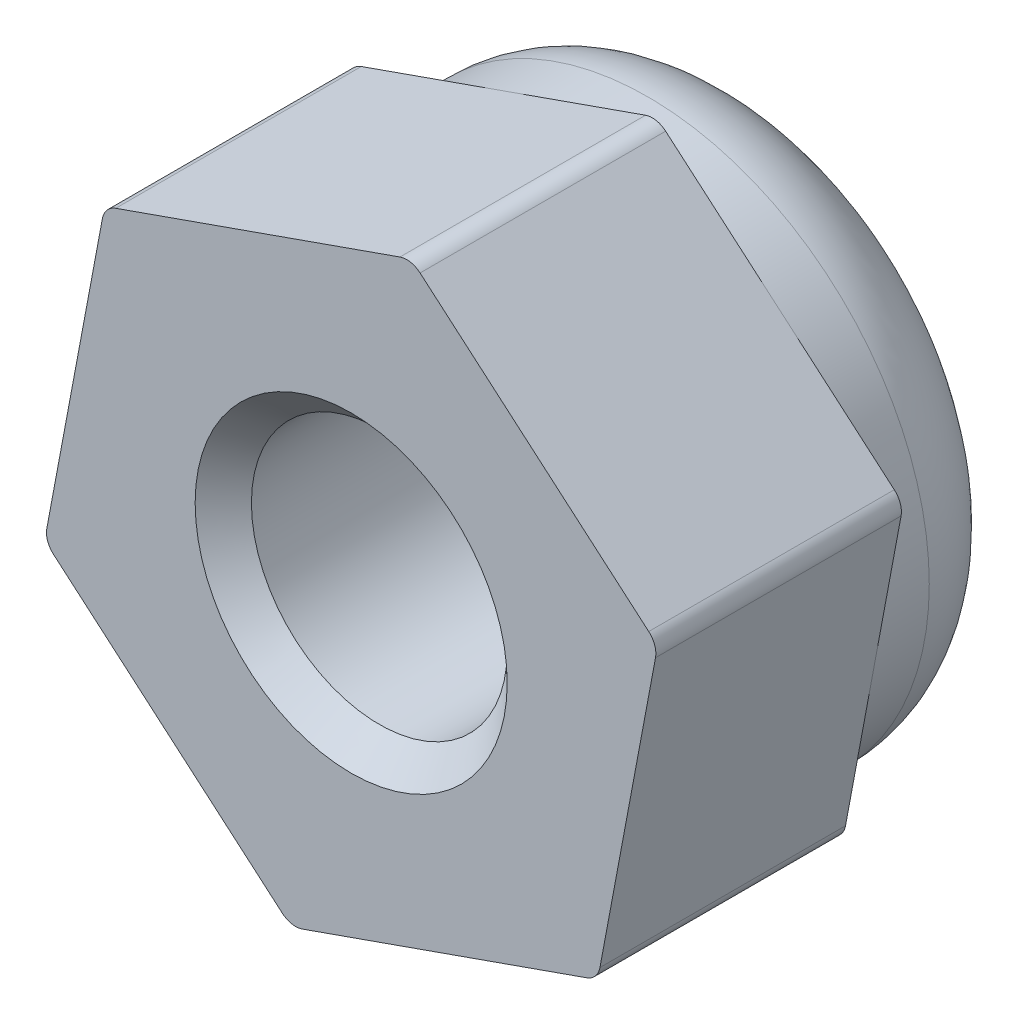
ISO-10303-21;
HEADER;
FILE_DESCRIPTION(('STEP AP214'),'2;1');
FILE_NAME('part.step','',(''),(''),'','','');
FILE_SCHEMA(('AUTOMOTIVE_DESIGN { 1 0 10303 214 1 1 1 1 }'));
ENDSEC;
DATA;
#1=APPLICATION_CONTEXT('core data for automotive mechanical design processes');
#2=APPLICATION_PROTOCOL_DEFINITION('international standard','automotive_design',2000,#1);
#3=PRODUCT_CONTEXT('',#1,'mechanical');
#4=PRODUCT('Part','Part','',(#3));
#5=PRODUCT_RELATED_PRODUCT_CATEGORY('part','',(#4));
#6=PRODUCT_DEFINITION_FORMATION('','',#4);
#7=PRODUCT_DEFINITION_CONTEXT('part definition',#1,'design');
#8=PRODUCT_DEFINITION('design','',#6,#7);
#9=PRODUCT_DEFINITION_SHAPE('','',#8);
#10=(LENGTH_UNIT() NAMED_UNIT(*) SI_UNIT(.MILLI.,.METRE.));
#11=(NAMED_UNIT(*) PLANE_ANGLE_UNIT() SI_UNIT($,.RADIAN.));
#12=(NAMED_UNIT(*) SI_UNIT($,.STERADIAN.) SOLID_ANGLE_UNIT());
#13=UNCERTAINTY_MEASURE_WITH_UNIT(LENGTH_MEASURE(1.E-05),#10,'distance_accuracy_value','');
#14=(GEOMETRIC_REPRESENTATION_CONTEXT(3) GLOBAL_UNCERTAINTY_ASSIGNED_CONTEXT((#13)) GLOBAL_UNIT_ASSIGNED_CONTEXT((#10,
#11,#12)) REPRESENTATION_CONTEXT('',''));
#15=CARTESIAN_POINT('',(0.,0.,0.));
#16=DIRECTION('',(0.,0.,1.));
#17=DIRECTION('',(1.,0.,0.));
#18=AXIS2_PLACEMENT_3D('',#15,#16,#17);
#19=CARTESIAN_POINT('',(0.,0.,0.));
#20=DIRECTION('',(0.,0.,1.));
#21=DIRECTION('',(1.,0.,0.));
#22=AXIS2_PLACEMENT_3D('',#19,#20,#21);
#23=PLANE('',#22);
#24=DIRECTION('',(-0.943398811601491,-0.331660492475205,0.));
#25=VECTOR('',#24,1.);
#26=CARTESIAN_POINT('',(0.585780429729244,3.12092848708194,0.));
#27=LINE('',#26,#25);
#28=CARTESIAN_POINT('',(0.476846118162986,3.08263163215991,0.));
#29=VERTEX_POINT('',#28);
#30=CARTESIAN_POINT('',(-0.912066354306814,2.5943467319041,0.));
#31=VERTEX_POINT('',#30);
#32=EDGE_CURVE('E200',#29,#31,#27,.T.);
#33=ORIENTED_EDGE('',*,*,#32,.F.);
#34=CARTESIAN_POINT('',(0.543178216658027,2.89395186983962,0.));
#35=DIRECTION('',(0.,0.,1.));
#36=DIRECTION('',(1.,0.,0.));
#37=AXIS2_PLACEMENT_3D('',#34,#35,#36);
#38=CIRCLE('',#37,0.2);
#39=CARTESIAN_POINT('',(0.673413634759894,3.0457370333828,0.));
#40=VERTEX_POINT('',#39);
#41=EDGE_CURVE('E269',#29,#40,#38,.F.);
#42=ORIENTED_EDGE('',*,*,#41,.T.);
#43=DIRECTION('',(-0.75892581771593,0.651177090509338,0.));
#44=VECTOR('',#43,1.);
#45=CARTESIAN_POINT('',(2.99569356807211,1.05316351035568,0.));
#46=LINE('',#45,#44);
#47=CARTESIAN_POINT('',(1.79073699890068,2.08704599871881,0.));
#48=VERTEX_POINT('',#47);
#49=EDGE_CURVE('E162',#48,#40,#46,.T.);
#50=ORIENTED_EDGE('',*,*,#49,.F.);
#51=CARTESIAN_POINT('',(0.,0.,0.));
#52=DIRECTION('',(0.,0.,1.));
#53=DIRECTION('',(1.,0.,0.));
#54=AXIS2_PLACEMENT_3D('',#51,#52,#53);
#55=CIRCLE('',#54,2.75);
#56=EDGE_CURVE('E175',#48,#31,#55,.T.);
#57=ORIENTED_EDGE('',*,*,#56,.T.);
#58=EDGE_LOOP('',(#33,#42,#50,#57));
#59=FACE_BOUND('',#58,.T.);
#60=ADVANCED_FACE('F41',(#59),#23,.F.);
#61=DIRECTION('',(-0.18447299388556,-0.982837582984543,0.));
#62=VECTOR('',#61,1.);
#63=CARTESIAN_POINT('',(-2.40991313834287,2.06776497672626,0.));
#64=LINE('',#63,#62);
#65=CARTESIAN_POINT('',(-2.43121424487848,1.9542766681051,0.));
#66=VERTEX_POINT('',#65);
#67=CARTESIAN_POINT('',(-2.70280335320749,0.507300733185291,0.));
#68=VERTEX_POINT('',#67);
#69=EDGE_CURVE('E204',#66,#68,#64,.T.);
#70=ORIENTED_EDGE('',*,*,#69,.F.);
#71=CARTESIAN_POINT('',(-2.23464672828157,1.91738206932799,0.));
#72=DIRECTION('',(0.,0.,1.));
#73=DIRECTION('',(1.,0.,0.));
#74=AXIS2_PLACEMENT_3D('',#71,#72,#73);
#75=CIRCLE('',#74,0.2);
#76=CARTESIAN_POINT('',(-2.30097882677661,2.10606183164828,0.));
#77=VERTEX_POINT('',#76);
#78=EDGE_CURVE('E279',#66,#77,#75,.F.);
#79=ORIENTED_EDGE('',*,*,#78,.T.);
#80=EDGE_CURVE('E199',#31,#77,#27,.T.);
#81=ORIENTED_EDGE('',*,*,#80,.F.);
#82=EDGE_CURVE('E426',#31,#68,#55,.T.);
#83=ORIENTED_EDGE('',*,*,#82,.T.);
#84=EDGE_LOOP('',(#70,#79,#81,#83));
#85=FACE_BOUND('',#84,.T.);
#86=ADVANCED_FACE('F353',(#85),#23,.F.);
#87=DIRECTION('',(0.75892581771593,-0.651177090509338,0.));
#88=VECTOR('',#87,1.);
#89=CARTESIAN_POINT('',(-2.99569356807212,-1.05316351035568,0.));
#90=LINE('',#89,#88);
#91=CARTESIAN_POINT('',(-2.90806036304147,-1.12835496405481,0.));
#92=VERTEX_POINT('',#91);
#93=CARTESIAN_POINT('',(-1.79073699890068,-2.08704599871881,0.));
#94=VERTEX_POINT('',#93);
#95=EDGE_CURVE('E208',#92,#94,#90,.T.);
#96=ORIENTED_EDGE('',*,*,#95,.F.);
#97=CARTESIAN_POINT('',(-2.7778249449396,-0.976569800511629,0.));
#98=DIRECTION('',(0.,0.,1.));
#99=DIRECTION('',(1.,0.,0.));
#100=AXIS2_PLACEMENT_3D('',#97,#98,#99);
#101=CIRCLE('',#100,0.2);
#102=CARTESIAN_POINT('',(-2.97439246153651,-0.939675201734518,0.));
#103=VERTEX_POINT('',#102);
#104=EDGE_CURVE('E51',#92,#103,#101,.F.);
#105=ORIENTED_EDGE('',*,*,#104,.T.);
#106=EDGE_CURVE('E203',#68,#103,#64,.T.);
#107=ORIENTED_EDGE('',*,*,#106,.F.);
#108=EDGE_CURVE('E428',#68,#94,#55,.T.);
#109=ORIENTED_EDGE('',*,*,#108,.T.);
#110=EDGE_LOOP('',(#96,#105,#107,#109));
#111=FACE_BOUND('',#110,.T.);
#112=ADVANCED_FACE('F293',(#111),#23,.F.);
#113=DIRECTION('',(0.94339881160149,0.331660492475205,0.));
#114=VECTOR('',#113,1.);
#115=CARTESIAN_POINT('',(-0.585780429729246,-3.12092848708194,0.));
#116=LINE('',#115,#114);
#117=CARTESIAN_POINT('',(-0.476846118162987,-3.08263163215991,0.));
#118=VERTEX_POINT('',#117);
#119=CARTESIAN_POINT('',(0.912066354306814,-2.5943467319041,0.));
#120=VERTEX_POINT('',#119);
#121=EDGE_CURVE('E191',#118,#120,#116,.T.);
#122=ORIENTED_EDGE('',*,*,#121,.F.);
#123=CARTESIAN_POINT('',(-0.543178216658028,-2.89395186983962,0.));
#124=DIRECTION('',(0.,0.,1.));
#125=DIRECTION('',(1.,0.,0.));
#126=AXIS2_PLACEMENT_3D('',#123,#124,#125);
#127=CIRCLE('',#126,0.2);
#128=CARTESIAN_POINT('',(-0.673413634759897,-3.0457370333828,0.));
#129=VERTEX_POINT('',#128);
#130=EDGE_CURVE('E11',#118,#129,#127,.F.);
#131=ORIENTED_EDGE('',*,*,#130,.T.);
#132=EDGE_CURVE('E207',#94,#129,#90,.T.);
#133=ORIENTED_EDGE('',*,*,#132,.F.);
#134=EDGE_CURVE('E187',#94,#120,#55,.T.);
#135=ORIENTED_EDGE('',*,*,#134,.T.);
#136=EDGE_LOOP('',(#122,#131,#133,#135));
#137=FACE_BOUND('',#136,.T.);
#138=ADVANCED_FACE('F432',(#137),#23,.F.);
#139=DIRECTION('',(0.184472993885561,0.982837582984543,0.));
#140=VECTOR('',#139,1.);
#141=CARTESIAN_POINT('',(2.40991313834287,-2.06776497672626,0.));
#142=LINE('',#141,#140);
#143=CARTESIAN_POINT('',(2.43121424487848,-1.9542766681051,0.));
#144=VERTEX_POINT('',#143);
#145=CARTESIAN_POINT('',(2.70280335320749,-0.507300733185292,0.));
#146=VERTEX_POINT('',#145);
#147=EDGE_CURVE('E150',#144,#146,#142,.T.);
#148=ORIENTED_EDGE('',*,*,#147,.F.);
#149=CARTESIAN_POINT('',(2.23464672828157,-1.91738206932799,0.));
#150=DIRECTION('',(0.,0.,1.));
#151=DIRECTION('',(1.,0.,0.));
#152=AXIS2_PLACEMENT_3D('',#149,#150,#151);
#153=CIRCLE('',#152,0.2);
#154=CARTESIAN_POINT('',(2.30097882677661,-2.10606183164828,0.));
#155=VERTEX_POINT('',#154);
#156=EDGE_CURVE('E225',#144,#155,#153,.F.);
#157=ORIENTED_EDGE('',*,*,#156,.T.);
#158=EDGE_CURVE('E185',#120,#155,#116,.T.);
#159=ORIENTED_EDGE('',*,*,#158,.F.);
#160=EDGE_CURVE('E171',#120,#146,#55,.T.);
#161=ORIENTED_EDGE('',*,*,#160,.T.);
#162=EDGE_LOOP('',(#148,#157,#159,#161));
#163=FACE_BOUND('',#162,.T.);
#164=ADVANCED_FACE('F183',(#163),#23,.F.);
#165=CARTESIAN_POINT('',(-0.585780429729246,-3.12092848708194,2.4));
#166=DIRECTION('',(-0.331660492475205,0.94339881160149,0.));
#167=DIRECTION('',(-0.943398811601491,-0.331660492475205,0.));
#168=AXIS2_PLACEMENT_3D('',#165,#166,#167);
#169=PLANE('',#168);
#170=ORIENTED_EDGE('',*,*,#158,.T.);
#171=DIRECTION('',(0.,0.,-1.));
#172=VECTOR('',#171,1.);
#173=CARTESIAN_POINT('',(2.30097882677661,-2.10606183164828,2.4));
#174=LINE('',#173,#172);
#175=CARTESIAN_POINT('',(2.30097882677661,-2.10606183164828,2.4));
#176=VERTEX_POINT('',#175);
#177=EDGE_CURVE('E232',#155,#176,#174,.F.);
#178=ORIENTED_EDGE('',*,*,#177,.T.);
#179=DIRECTION('',(0.94339881160149,0.331660492475205,0.));
#180=VECTOR('',#179,1.);
#181=CARTESIAN_POINT('',(-0.585780429729246,-3.12092848708194,2.4));
#182=LINE('',#181,#180);
#183=CARTESIAN_POINT('',(-0.476846118162987,-3.08263163215991,2.4));
#184=VERTEX_POINT('',#183);
#185=EDGE_CURVE('E210',#184,#176,#182,.T.);
#186=ORIENTED_EDGE('',*,*,#185,.F.);
#187=DIRECTION('',(0.,0.,-1.));
#188=VECTOR('',#187,1.);
#189=CARTESIAN_POINT('',(-0.476846118162987,-3.08263163215991,2.4));
#190=LINE('',#189,#188);
#191=EDGE_CURVE('E228',#184,#118,#190,.T.);
#192=ORIENTED_EDGE('',*,*,#191,.T.);
#193=ORIENTED_EDGE('',*,*,#121,.T.);
#194=EDGE_LOOP('',(#170,#178,#186,#192,#193));
#195=FACE_BOUND('',#194,.T.);
#196=ADVANCED_FACE('F373',(#195),#169,.F.);
#197=CARTESIAN_POINT('',(2.40991313834287,-2.06776497672626,2.4));
#198=DIRECTION('',(-0.982837582984543,0.184472993885561,0.));
#199=DIRECTION('',(-0.184472993885561,-0.982837582984543,0.));
#200=AXIS2_PLACEMENT_3D('',#197,#198,#199);
#201=PLANE('',#200);
#202=DIRECTION('',(0.184472993885561,0.982837582984543,0.));
#203=VECTOR('',#202,1.);
#204=CARTESIAN_POINT('',(2.40991313834287,-2.06776497672626,2.4));
#205=LINE('',#204,#203);
#206=CARTESIAN_POINT('',(2.43121424487848,-1.9542766681051,2.4));
#207=VERTEX_POINT('',#206);
#208=CARTESIAN_POINT('',(2.97439246153651,0.939675201734518,2.4));
#209=VERTEX_POINT('',#208);
#210=EDGE_CURVE('E326',#207,#209,#205,.T.);
#211=ORIENTED_EDGE('',*,*,#210,.F.);
#212=DIRECTION('',(0.,0.,-1.));
#213=VECTOR('',#212,1.);
#214=CARTESIAN_POINT('',(2.43121424487848,-1.9542766681051,2.4));
#215=LINE('',#214,#213);
#216=EDGE_CURVE('E158',#207,#144,#215,.T.);
#217=ORIENTED_EDGE('',*,*,#216,.T.);
#218=ORIENTED_EDGE('',*,*,#147,.T.);
#219=CARTESIAN_POINT('',(2.97439246153651,0.939675201734518,0.));
#220=VERTEX_POINT('',#219);
#221=EDGE_CURVE('E155',#146,#220,#142,.T.);
#222=ORIENTED_EDGE('',*,*,#221,.T.);
#223=DIRECTION('',(0.,0.,-1.));
#224=VECTOR('',#223,1.);
#225=CARTESIAN_POINT('',(2.97439246153651,0.939675201734517,2.4));
#226=LINE('',#225,#224);
#227=EDGE_CURVE('E220',#220,#209,#226,.F.);
#228=ORIENTED_EDGE('',*,*,#227,.T.);
#229=EDGE_LOOP('',(#211,#217,#218,#222,#228));
#230=FACE_BOUND('',#229,.T.);
#231=ADVANCED_FACE('F153',(#230),#201,.F.);
#232=CARTESIAN_POINT('',(2.99569356807211,1.05316351035568,2.4));
#233=DIRECTION('',(-0.651177090509338,-0.75892581771593,0.));
#234=DIRECTION('',(0.75892581771593,-0.651177090509338,0.));
#235=AXIS2_PLACEMENT_3D('',#232,#233,#234);
#236=PLANE('',#235);
#237=DIRECTION('',(-0.75892581771593,0.651177090509338,0.));
#238=VECTOR('',#237,1.);
#239=CARTESIAN_POINT('',(2.99569356807211,1.05316351035568,2.4));
#240=LINE('',#239,#238);
#241=CARTESIAN_POINT('',(2.90806036304146,1.12835496405482,2.4));
#242=VERTEX_POINT('',#241);
#243=CARTESIAN_POINT('',(0.673413634759894,3.0457370333828,2.4));
#244=VERTEX_POINT('',#243);
#245=EDGE_CURVE('E322',#242,#244,#240,.T.);
#246=ORIENTED_EDGE('',*,*,#245,.F.);
#247=DIRECTION('',(0.,0.,-1.));
#248=VECTOR('',#247,1.);
#249=CARTESIAN_POINT('',(2.90806036304146,1.12835496405482,2.4));
#250=LINE('',#249,#248);
#251=CARTESIAN_POINT('',(2.90806036304146,1.12835496405482,0.));
#252=VERTEX_POINT('',#251);
#253=EDGE_CURVE('E256',#242,#252,#250,.T.);
#254=ORIENTED_EDGE('',*,*,#253,.T.);
#255=EDGE_CURVE('E196',#252,#48,#46,.T.);
#256=ORIENTED_EDGE('',*,*,#255,.T.);
#257=ORIENTED_EDGE('',*,*,#49,.T.);
#258=DIRECTION('',(0.,0.,-1.));
#259=VECTOR('',#258,1.);
#260=CARTESIAN_POINT('',(0.673413634759894,3.0457370333828,2.4));
#261=LINE('',#260,#259);
#262=EDGE_CURVE('E253',#40,#244,#261,.F.);
#263=ORIENTED_EDGE('',*,*,#262,.T.);
#264=EDGE_LOOP('',(#246,#254,#256,#257,#263));
#265=FACE_BOUND('',#264,.T.);
#266=ADVANCED_FACE('F366',(#265),#236,.F.);
#267=CARTESIAN_POINT('',(0.585780429729244,3.12092848708194,2.4));
#268=DIRECTION('',(0.331660492475205,-0.94339881160149,0.));
#269=DIRECTION('',(0.943398811601491,0.331660492475205,0.));
#270=AXIS2_PLACEMENT_3D('',#267,#268,#269);
#271=PLANE('',#270);
#272=DIRECTION('',(-0.943398811601491,-0.331660492475205,0.));
#273=VECTOR('',#272,1.);
#274=CARTESIAN_POINT('',(0.585780429729244,3.12092848708194,2.4));
#275=LINE('',#274,#273);
#276=CARTESIAN_POINT('',(0.476846118162986,3.08263163215991,2.4));
#277=VERTEX_POINT('',#276);
#278=CARTESIAN_POINT('',(-2.30097882677661,2.10606183164828,2.4));
#279=VERTEX_POINT('',#278);
#280=EDGE_CURVE('E316',#277,#279,#275,.T.);
#281=ORIENTED_EDGE('',*,*,#280,.F.);
#282=DIRECTION('',(0.,0.,-1.));
#283=VECTOR('',#282,1.);
#284=CARTESIAN_POINT('',(0.476846118162986,3.08263163215991,2.4));
#285=LINE('',#284,#283);
#286=EDGE_CURVE('E265',#277,#29,#285,.T.);
#287=ORIENTED_EDGE('',*,*,#286,.T.);
#288=ORIENTED_EDGE('',*,*,#32,.T.);
#289=ORIENTED_EDGE('',*,*,#80,.T.);
#290=DIRECTION('',(0.,0.,-1.));
#291=VECTOR('',#290,1.);
#292=CARTESIAN_POINT('',(-2.30097882677661,2.10606183164828,2.4));
#293=LINE('',#292,#291);
#294=EDGE_CURVE('E262',#77,#279,#293,.F.);
#295=ORIENTED_EDGE('',*,*,#294,.T.);
#296=EDGE_LOOP('',(#281,#287,#288,#289,#295));
#297=FACE_BOUND('',#296,.T.);
#298=ADVANCED_FACE('F363',(#297),#271,.F.);
#299=CARTESIAN_POINT('',(-2.40991313834287,2.06776497672626,2.4));
#300=DIRECTION('',(0.982837582984543,-0.18447299388556,0.));
#301=DIRECTION('',(0.18447299388556,0.982837582984543,0.));
#302=AXIS2_PLACEMENT_3D('',#299,#300,#301);
#303=PLANE('',#302);
#304=DIRECTION('',(-0.18447299388556,-0.982837582984543,0.));
#305=VECTOR('',#304,1.);
#306=CARTESIAN_POINT('',(-2.40991313834287,2.06776497672626,2.4));
#307=LINE('',#306,#305);
#308=CARTESIAN_POINT('',(-2.43121424487848,1.9542766681051,2.4));
#309=VERTEX_POINT('',#308);
#310=CARTESIAN_POINT('',(-2.97439246153651,-0.939675201734518,2.4));
#311=VERTEX_POINT('',#310);
#312=EDGE_CURVE('E310',#309,#311,#307,.T.);
#313=ORIENTED_EDGE('',*,*,#312,.F.);
#314=DIRECTION('',(0.,0.,-1.));
#315=VECTOR('',#314,1.);
#316=CARTESIAN_POINT('',(-2.43121424487848,1.9542766681051,2.4));
#317=LINE('',#316,#315);
#318=EDGE_CURVE('E275',#309,#66,#317,.T.);
#319=ORIENTED_EDGE('',*,*,#318,.T.);
#320=ORIENTED_EDGE('',*,*,#69,.T.);
#321=ORIENTED_EDGE('',*,*,#106,.T.);
#322=DIRECTION('',(0.,0.,-1.));
#323=VECTOR('',#322,1.);
#324=CARTESIAN_POINT('',(-2.97439246153651,-0.939675201734517,2.4));
#325=LINE('',#324,#323);
#326=EDGE_CURVE('E272',#103,#311,#325,.F.);
#327=ORIENTED_EDGE('',*,*,#326,.T.);
#328=EDGE_LOOP('',(#313,#319,#320,#321,#327));
#329=FACE_BOUND('',#328,.T.);
#330=ADVANCED_FACE('F297',(#329),#303,.F.);
#331=CARTESIAN_POINT('',(-2.99569356807212,-1.05316351035568,2.4));
#332=DIRECTION('',(0.651177090509338,0.75892581771593,0.));
#333=DIRECTION('',(-0.75892581771593,0.651177090509338,0.));
#334=AXIS2_PLACEMENT_3D('',#331,#332,#333);
#335=PLANE('',#334);
#336=DIRECTION('',(0.75892581771593,-0.651177090509338,0.));
#337=VECTOR('',#336,1.);
#338=CARTESIAN_POINT('',(-2.99569356807212,-1.05316351035568,2.4));
#339=LINE('',#338,#337);
#340=CARTESIAN_POINT('',(-2.90806036304147,-1.12835496405481,2.4));
#341=VERTEX_POINT('',#340);
#342=CARTESIAN_POINT('',(-0.673413634759897,-3.0457370333828,2.4));
#343=VERTEX_POINT('',#342);
#344=EDGE_CURVE('E180',#341,#343,#339,.T.);
#345=ORIENTED_EDGE('',*,*,#344,.F.);
#346=DIRECTION('',(0.,0.,-1.));
#347=VECTOR('',#346,1.);
#348=CARTESIAN_POINT('',(-2.90806036304147,-1.12835496405481,2.4));
#349=LINE('',#348,#347);
#350=EDGE_CURVE('E285',#341,#92,#349,.T.);
#351=ORIENTED_EDGE('',*,*,#350,.T.);
#352=ORIENTED_EDGE('',*,*,#95,.T.);
#353=ORIENTED_EDGE('',*,*,#132,.T.);
#354=DIRECTION('',(0.,0.,-1.));
#355=VECTOR('',#354,1.);
#356=CARTESIAN_POINT('',(-0.673413634759896,-3.0457370333828,2.4));
#357=LINE('',#356,#355);
#358=EDGE_CURVE('E282',#129,#343,#357,.F.);
#359=ORIENTED_EDGE('',*,*,#358,.T.);
#360=EDGE_LOOP('',(#345,#351,#352,#353,#359));
#361=FACE_BOUND('',#360,.T.);
#362=ADVANCED_FACE('F312',(#361),#335,.F.);
#363=CARTESIAN_POINT('',(0.,0.,2.4));
#364=DIRECTION('',(0.,0.,1.));
#365=DIRECTION('',(1.,0.,0.));
#366=AXIS2_PLACEMENT_3D('',#363,#364,#365);
#367=PLANE('',#366);
#368=CARTESIAN_POINT('',(0.,0.,2.4));
#369=DIRECTION('',(0.,0.,1.));
#370=DIRECTION('',(1.,0.,0.));
#371=AXIS2_PLACEMENT_3D('',#368,#369,#370);
#372=CIRCLE('',#371,1.525);
#373=CARTESIAN_POINT('',(1.525,0.,2.4));
#374=VERTEX_POINT('',#373);
#375=EDGE_CURVE('E336',#374,#374,#372,.T.);
#376=ORIENTED_EDGE('',*,*,#375,.F.);
#377=EDGE_LOOP('',(#376));
#378=FACE_BOUND('',#377,.T.);
#379=ORIENTED_EDGE('',*,*,#185,.T.);
#380=CARTESIAN_POINT('',(2.23464672828157,-1.91738206932799,2.4));
#381=DIRECTION('',(0.,0.,1.));
#382=DIRECTION('',(1.,0.,0.));
#383=AXIS2_PLACEMENT_3D('',#380,#381,#382);
#384=CIRCLE('',#383,0.2);
#385=EDGE_CURVE('E250',#176,#207,#384,.T.);
#386=ORIENTED_EDGE('',*,*,#385,.T.);
#387=ORIENTED_EDGE('',*,*,#210,.T.);
#388=CARTESIAN_POINT('',(2.7778249449396,0.97656980051163,2.4));
#389=DIRECTION('',(0.,0.,1.));
#390=DIRECTION('',(1.,0.,0.));
#391=AXIS2_PLACEMENT_3D('',#388,#389,#390);
#392=CIRCLE('',#391,0.2);
#393=EDGE_CURVE('E247',#209,#242,#392,.T.);
#394=ORIENTED_EDGE('',*,*,#393,.T.);
#395=ORIENTED_EDGE('',*,*,#245,.T.);
#396=CARTESIAN_POINT('',(0.543178216658027,2.89395186983962,2.4));
#397=DIRECTION('',(0.,0.,1.));
#398=DIRECTION('',(1.,0.,0.));
#399=AXIS2_PLACEMENT_3D('',#396,#397,#398);
#400=CIRCLE('',#399,0.2);
#401=EDGE_CURVE('E244',#244,#277,#400,.T.);
#402=ORIENTED_EDGE('',*,*,#401,.T.);
#403=ORIENTED_EDGE('',*,*,#280,.T.);
#404=CARTESIAN_POINT('',(-2.23464672828157,1.91738206932799,2.4));
#405=DIRECTION('',(0.,0.,1.));
#406=DIRECTION('',(1.,0.,0.));
#407=AXIS2_PLACEMENT_3D('',#404,#405,#406);
#408=CIRCLE('',#407,0.2);
#409=EDGE_CURVE('E241',#279,#309,#408,.T.);
#410=ORIENTED_EDGE('',*,*,#409,.T.);
#411=ORIENTED_EDGE('',*,*,#312,.T.);
#412=CARTESIAN_POINT('',(-2.7778249449396,-0.976569800511629,2.4));
#413=DIRECTION('',(0.,0.,1.));
#414=DIRECTION('',(1.,0.,0.));
#415=AXIS2_PLACEMENT_3D('',#412,#413,#414);
#416=CIRCLE('',#415,0.2);
#417=EDGE_CURVE('E238',#311,#341,#416,.T.);
#418=ORIENTED_EDGE('',*,*,#417,.T.);
#419=ORIENTED_EDGE('',*,*,#344,.T.);
#420=CARTESIAN_POINT('',(-0.543178216658028,-2.89395186983962,2.4));
#421=DIRECTION('',(0.,0.,1.));
#422=DIRECTION('',(1.,0.,0.));
#423=AXIS2_PLACEMENT_3D('',#420,#421,#422);
#424=CIRCLE('',#423,0.2);
#425=EDGE_CURVE('E235',#343,#184,#424,.T.);
#426=ORIENTED_EDGE('',*,*,#425,.T.);
#427=EDGE_LOOP('',(#379,#386,#387,#394,#395,#402,#403,#410,#411,#418,#419,#426));
#428=FACE_BOUND('',#427,.T.);
#429=ADVANCED_FACE('F308',(#378,#428),#367,.T.);
#430=ORIENTED_EDGE('',*,*,#255,.F.);
#431=CARTESIAN_POINT('',(2.7778249449396,0.97656980051163,0.));
#432=DIRECTION('',(0.,0.,1.));
#433=DIRECTION('',(1.,0.,0.));
#434=AXIS2_PLACEMENT_3D('',#431,#432,#433);
#435=CIRCLE('',#434,0.2);
#436=EDGE_CURVE('E189',#252,#220,#435,.F.);
#437=ORIENTED_EDGE('',*,*,#436,.T.);
#438=ORIENTED_EDGE('',*,*,#221,.F.);
#439=EDGE_CURVE('E168',#146,#48,#55,.T.);
#440=ORIENTED_EDGE('',*,*,#439,.T.);
#441=EDGE_LOOP('',(#430,#437,#438,#440));
#442=FACE_BOUND('',#441,.T.);
#443=ADVANCED_FACE('F188',(#442),#23,.F.);
#444=CARTESIAN_POINT('',(0.,0.,-1.5));
#445=DIRECTION('',(0.,0.,1.));
#446=DIRECTION('',(1.,0.,0.));
#447=AXIS2_PLACEMENT_3D('',#444,#445,#446);
#448=CYLINDRICAL_SURFACE('',#447,2.75);
#449=CARTESIAN_POINT('',(0.,0.,-0.5));
#450=DIRECTION('',(0.,0.,1.));
#451=DIRECTION('',(1.,0.,0.));
#452=AXIS2_PLACEMENT_3D('',#449,#450,#451);
#453=CIRCLE('',#452,2.75);
#454=CARTESIAN_POINT('',(2.75,0.,-0.5));
#455=VERTEX_POINT('',#454);
#456=EDGE_CURVE('E212',#455,#455,#453,.T.);
#457=ORIENTED_EDGE('',*,*,#456,.T.);
#458=EDGE_LOOP('',(#457));
#459=FACE_BOUND('',#458,.T.);
#460=ORIENTED_EDGE('',*,*,#56,.F.);
#461=ORIENTED_EDGE('',*,*,#439,.F.);
#462=ORIENTED_EDGE('',*,*,#160,.F.);
#463=ORIENTED_EDGE('',*,*,#134,.F.);
#464=ORIENTED_EDGE('',*,*,#108,.F.);
#465=ORIENTED_EDGE('',*,*,#82,.F.);
#466=EDGE_LOOP('',(#460,#461,#462,#463,#464,#465));
#467=FACE_BOUND('',#466,.T.);
#468=ADVANCED_FACE('F169',(#459,#467),#448,.T.);
#469=CARTESIAN_POINT('',(0.,0.,-1.5));
#470=DIRECTION('',(0.,0.,1.));
#471=DIRECTION('',(1.,0.,0.));
#472=AXIS2_PLACEMENT_3D('',#469,#470,#471);
#473=PLANE('',#472);
#474=CARTESIAN_POINT('',(0.,0.,-1.5));
#475=DIRECTION('',(0.,0.,1.));
#476=DIRECTION('',(1.,0.,0.));
#477=AXIS2_PLACEMENT_3D('',#474,#475,#476);
#478=CIRCLE('',#477,1.25);
#479=CARTESIAN_POINT('',(1.25,0.,-1.5));
#480=VERTEX_POINT('',#479);
#481=EDGE_CURVE('E45',#480,#480,#478,.T.);
#482=ORIENTED_EDGE('',*,*,#481,.T.);
#483=EDGE_LOOP('',(#482));
#484=FACE_BOUND('',#483,.T.);
#485=CARTESIAN_POINT('',(0.,0.,-1.5));
#486=DIRECTION('',(0.,0.,1.));
#487=DIRECTION('',(1.,0.,0.));
#488=AXIS2_PLACEMENT_3D('',#485,#486,#487);
#489=CIRCLE('',#488,1.75);
#490=CARTESIAN_POINT('',(1.75,0.,-1.5));
#491=VERTEX_POINT('',#490);
#492=EDGE_CURVE('E216',#491,#491,#489,.F.);
#493=ORIENTED_EDGE('',*,*,#492,.T.);
#494=EDGE_LOOP('',(#493));
#495=FACE_BOUND('',#494,.T.);
#496=ADVANCED_FACE('F381',(#484,#495),#473,.F.);
#497=CARTESIAN_POINT('',(0.,0.,-0.5));
#498=DIRECTION('',(0.,0.,1.));
#499=DIRECTION('',(1.,0.,0.));
#500=AXIS2_PLACEMENT_3D('',#497,#498,#499);
#501=TOROIDAL_SURFACE('',#500,1.75,1.);
#502=ORIENTED_EDGE('',*,*,#492,.F.);
#503=EDGE_LOOP('',(#502));
#504=FACE_BOUND('',#503,.T.);
#505=ORIENTED_EDGE('',*,*,#456,.F.);
#506=EDGE_LOOP('',(#505));
#507=FACE_BOUND('',#506,.T.);
#508=ADVANCED_FACE('F377',(#504,#507),#501,.T.);
#509=CARTESIAN_POINT('',(2.23464672828157,-1.91738206932799,2.4));
#510=DIRECTION('',(0.,0.,-1.));
#511=DIRECTION('',(-1.,0.,0.));
#512=AXIS2_PLACEMENT_3D('',#509,#510,#511);
#513=CYLINDRICAL_SURFACE('',#512,0.2);
#514=ORIENTED_EDGE('',*,*,#385,.F.);
#515=ORIENTED_EDGE('',*,*,#177,.F.);
#516=ORIENTED_EDGE('',*,*,#156,.F.);
#517=ORIENTED_EDGE('',*,*,#216,.F.);
#518=EDGE_LOOP('',(#514,#515,#516,#517));
#519=FACE_BOUND('',#518,.T.);
#520=ADVANCED_FACE('F380',(#519),#513,.T.);
#521=CARTESIAN_POINT('',(2.7778249449396,0.97656980051163,2.4));
#522=DIRECTION('',(0.,0.,-1.));
#523=DIRECTION('',(-1.,0.,0.));
#524=AXIS2_PLACEMENT_3D('',#521,#522,#523);
#525=CYLINDRICAL_SURFACE('',#524,0.2);
#526=ORIENTED_EDGE('',*,*,#393,.F.);
#527=ORIENTED_EDGE('',*,*,#227,.F.);
#528=ORIENTED_EDGE('',*,*,#436,.F.);
#529=ORIENTED_EDGE('',*,*,#253,.F.);
#530=EDGE_LOOP('',(#526,#527,#528,#529));
#531=FACE_BOUND('',#530,.T.);
#532=ADVANCED_FACE('F385',(#531),#525,.T.);
#533=CARTESIAN_POINT('',(0.543178216658027,2.89395186983962,2.4));
#534=DIRECTION('',(0.,0.,-1.));
#535=DIRECTION('',(-1.,0.,0.));
#536=AXIS2_PLACEMENT_3D('',#533,#534,#535);
#537=CYLINDRICAL_SURFACE('',#536,0.2);
#538=ORIENTED_EDGE('',*,*,#401,.F.);
#539=ORIENTED_EDGE('',*,*,#262,.F.);
#540=ORIENTED_EDGE('',*,*,#41,.F.);
#541=ORIENTED_EDGE('',*,*,#286,.F.);
#542=EDGE_LOOP('',(#538,#539,#540,#541));
#543=FACE_BOUND('',#542,.T.);
#544=ADVANCED_FACE('F389',(#543),#537,.T.);
#545=CARTESIAN_POINT('',(-2.23464672828157,1.91738206932799,2.4));
#546=DIRECTION('',(0.,0.,-1.));
#547=DIRECTION('',(-1.,0.,0.));
#548=AXIS2_PLACEMENT_3D('',#545,#546,#547);
#549=CYLINDRICAL_SURFACE('',#548,0.2);
#550=ORIENTED_EDGE('',*,*,#409,.F.);
#551=ORIENTED_EDGE('',*,*,#294,.F.);
#552=ORIENTED_EDGE('',*,*,#78,.F.);
#553=ORIENTED_EDGE('',*,*,#318,.F.);
#554=EDGE_LOOP('',(#550,#551,#552,#553));
#555=FACE_BOUND('',#554,.T.);
#556=ADVANCED_FACE('F393',(#555),#549,.T.);
#557=CARTESIAN_POINT('',(-2.7778249449396,-0.976569800511629,2.4));
#558=DIRECTION('',(0.,0.,-1.));
#559=DIRECTION('',(-1.,0.,0.));
#560=AXIS2_PLACEMENT_3D('',#557,#558,#559);
#561=CYLINDRICAL_SURFACE('',#560,0.2);
#562=ORIENTED_EDGE('',*,*,#417,.F.);
#563=ORIENTED_EDGE('',*,*,#326,.F.);
#564=ORIENTED_EDGE('',*,*,#104,.F.);
#565=ORIENTED_EDGE('',*,*,#350,.F.);
#566=EDGE_LOOP('',(#562,#563,#564,#565));
#567=FACE_BOUND('',#566,.T.);
#568=ADVANCED_FACE('F303',(#567),#561,.T.);
#569=CARTESIAN_POINT('',(-0.543178216658028,-2.89395186983962,2.4));
#570=DIRECTION('',(0.,0.,-1.));
#571=DIRECTION('',(-1.,0.,0.));
#572=AXIS2_PLACEMENT_3D('',#569,#570,#571);
#573=CYLINDRICAL_SURFACE('',#572,0.2);
#574=ORIENTED_EDGE('',*,*,#425,.F.);
#575=ORIENTED_EDGE('',*,*,#358,.F.);
#576=ORIENTED_EDGE('',*,*,#130,.F.);
#577=ORIENTED_EDGE('',*,*,#191,.F.);
#578=EDGE_LOOP('',(#574,#575,#576,#577));
#579=FACE_BOUND('',#578,.T.);
#580=ADVANCED_FACE('F43',(#579),#573,.T.);
#581=CARTESIAN_POINT('',(0.,0.,2.4));
#582=DIRECTION('',(0.,0.,1.));
#583=DIRECTION('',(1.,0.,0.));
#584=AXIS2_PLACEMENT_3D('',#581,#582,#583);
#585=CYLINDRICAL_SURFACE('',#584,1.25);
#586=CARTESIAN_POINT('',(0.,0.,2.125));
#587=DIRECTION('',(0.,0.,1.));
#588=DIRECTION('',(1.,0.,0.));
#589=AXIS2_PLACEMENT_3D('',#586,#587,#588);
#590=CIRCLE('',#589,1.25);
#591=CARTESIAN_POINT('',(1.25,0.,2.125));
#592=VERTEX_POINT('',#591);
#593=EDGE_CURVE('E332',#592,#592,#590,.T.);
#594=ORIENTED_EDGE('',*,*,#593,.T.);
#595=EDGE_LOOP('',(#594));
#596=FACE_BOUND('',#595,.T.);
#597=ORIENTED_EDGE('',*,*,#481,.F.);
#598=EDGE_LOOP('',(#597));
#599=FACE_BOUND('',#598,.T.);
#600=ADVANCED_FACE('F401',(#596,#599),#585,.F.);
#601=CARTESIAN_POINT('',(0.,0.,2.4));
#602=DIRECTION('',(0.,0.,1.));
#603=DIRECTION('',(1.,0.,0.));
#604=AXIS2_PLACEMENT_3D('',#601,#602,#603);
#605=CONICAL_SURFACE('',#604,1.525,0.785398163397452);
#606=ORIENTED_EDGE('',*,*,#593,.F.);
#607=EDGE_LOOP('',(#606));
#608=FACE_BOUND('',#607,.T.);
#609=ORIENTED_EDGE('',*,*,#375,.T.);
#610=EDGE_LOOP('',(#609));
#611=FACE_BOUND('',#610,.T.);
#612=ADVANCED_FACE('F341',(#608,#611),#605,.F.);
#613=CLOSED_SHELL('',(#60,#86,#112,#138,#164,#196,#231,#266,#298,#330,#362,#429,#443,#468,#496,
#508,#520,#532,#544,#556,#568,#580,#600,#612));
#614=MANIFOLD_SOLID_BREP('B2',#613);
#615=ADVANCED_BREP_SHAPE_REPRESENTATION('',(#18,#614),#14);
#616=SHAPE_DEFINITION_REPRESENTATION(#9,#615);
ENDSEC;
END-ISO-10303-21;
